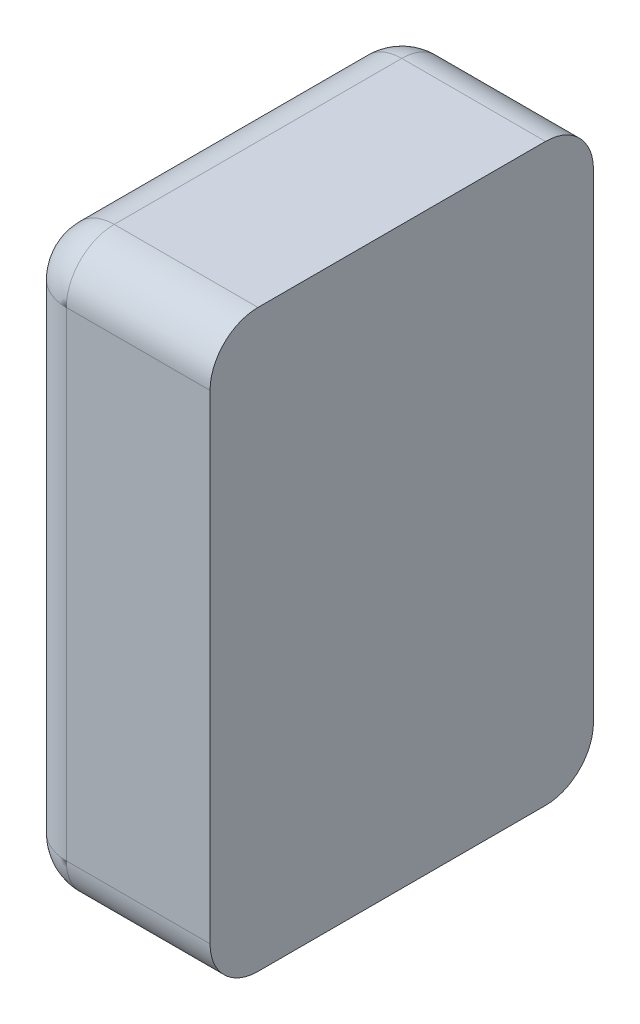
ISO-10303-21;
HEADER;
FILE_DESCRIPTION(('STEP AP214'),'2;1');
FILE_NAME('part.step','',(''),(''),'','','');
FILE_SCHEMA(('AUTOMOTIVE_DESIGN { 1 0 10303 214 1 1 1 1 }'));
ENDSEC;
DATA;
#1=APPLICATION_CONTEXT('core data for automotive mechanical design processes');
#2=APPLICATION_PROTOCOL_DEFINITION('international standard','automotive_design',2000,#1);
#3=PRODUCT_CONTEXT('',#1,'mechanical');
#4=PRODUCT('Part','Part','',(#3));
#5=PRODUCT_RELATED_PRODUCT_CATEGORY('part','',(#4));
#6=PRODUCT_DEFINITION_FORMATION('','',#4);
#7=PRODUCT_DEFINITION_CONTEXT('part definition',#1,'design');
#8=PRODUCT_DEFINITION('design','',#6,#7);
#9=PRODUCT_DEFINITION_SHAPE('','',#8);
#10=(LENGTH_UNIT() NAMED_UNIT(*) SI_UNIT(.MILLI.,.METRE.));
#11=(NAMED_UNIT(*) PLANE_ANGLE_UNIT() SI_UNIT($,.RADIAN.));
#12=(NAMED_UNIT(*) SI_UNIT($,.STERADIAN.) SOLID_ANGLE_UNIT());
#13=UNCERTAINTY_MEASURE_WITH_UNIT(LENGTH_MEASURE(1.E-05),#10,'distance_accuracy_value','');
#14=(GEOMETRIC_REPRESENTATION_CONTEXT(3) GLOBAL_UNCERTAINTY_ASSIGNED_CONTEXT((#13)) GLOBAL_UNIT_ASSIGNED_CONTEXT((#10,
#11,#12)) REPRESENTATION_CONTEXT('',''));
#15=CARTESIAN_POINT('',(0.,0.,0.));
#16=DIRECTION('',(0.,0.,1.));
#17=DIRECTION('',(1.,0.,0.));
#18=AXIS2_PLACEMENT_3D('',#15,#16,#17);
#19=CARTESIAN_POINT('',(-0.25,-0.15,0.));
#20=DIRECTION('',(0.,0.,1.));
#21=DIRECTION('',(1.,0.,0.));
#22=AXIS2_PLACEMENT_3D('',#19,#20,#21);
#23=PLANE('',#22);
#24=DIRECTION('',(0.,1.,0.));
#25=VECTOR('',#24,1.);
#26=CARTESIAN_POINT('',(-0.275,-0.15,0.));
#27=LINE('',#26,#25);
#28=CARTESIAN_POINT('',(-0.275,-0.125,0.));
#29=VERTEX_POINT('',#28);
#30=CARTESIAN_POINT('',(-0.275,0.125,0.));
#31=VERTEX_POINT('',#30);
#32=EDGE_CURVE('E197',#29,#31,#27,.T.);
#33=ORIENTED_EDGE('',*,*,#32,.T.);
#34=DIRECTION('',(1.,0.,0.));
#35=VECTOR('',#34,1.);
#36=CARTESIAN_POINT('',(-0.25,0.125,0.));
#37=LINE('',#36,#35);
#38=CARTESIAN_POINT('',(-0.2,0.125,0.));
#39=VERTEX_POINT('',#38);
#40=EDGE_CURVE('E124',#31,#39,#37,.T.);
#41=ORIENTED_EDGE('',*,*,#40,.T.);
#42=DIRECTION('',(0.,1.,0.));
#43=VECTOR('',#42,1.);
#44=CARTESIAN_POINT('',(-0.2,-0.15,0.));
#45=LINE('',#44,#43);
#46=CARTESIAN_POINT('',(-0.2,-0.125,0.));
#47=VERTEX_POINT('',#46);
#48=EDGE_CURVE('E242',#47,#39,#45,.T.);
#49=ORIENTED_EDGE('',*,*,#48,.F.);
#50=DIRECTION('',(-1.,0.,0.));
#51=VECTOR('',#50,1.);
#52=CARTESIAN_POINT('',(-0.3,-0.125,0.));
#53=LINE('',#52,#51);
#54=EDGE_CURVE('E200',#47,#29,#53,.T.);
#55=ORIENTED_EDGE('',*,*,#54,.T.);
#56=EDGE_LOOP('',(#33,#41,#49,#55));
#57=FACE_BOUND('',#56,.T.);
#58=ADVANCED_FACE('F17',(#57),#23,.F.);
#59=CARTESIAN_POINT('',(-0.15,-0.15,0.1));
#60=DIRECTION('',(0.,-1.,0.));
#61=DIRECTION('',(0.,0.,-1.));
#62=AXIS2_PLACEMENT_3D('',#59,#60,#61);
#63=PLANE('',#62);
#64=DIRECTION('',(0.,0.,1.));
#65=VECTOR('',#64,1.);
#66=CARTESIAN_POINT('',(-0.2,-0.15,0.189600024));
#67=LINE('',#66,#65);
#68=CARTESIAN_POINT('',(-0.2,-0.15,0.025));
#69=VERTEX_POINT('',#68);
#70=CARTESIAN_POINT('',(-0.2,-0.15,0.175));
#71=VERTEX_POINT('',#70);
#72=EDGE_CURVE('E219',#69,#71,#67,.T.);
#73=ORIENTED_EDGE('',*,*,#72,.T.);
#74=DIRECTION('',(-1.,0.,0.));
#75=VECTOR('',#74,1.);
#76=CARTESIAN_POINT('',(-0.3,-0.15,0.175));
#77=LINE('',#76,#75);
#78=CARTESIAN_POINT('',(-0.275,-0.15,0.175));
#79=VERTEX_POINT('',#78);
#80=EDGE_CURVE('E11',#71,#79,#77,.T.);
#81=ORIENTED_EDGE('',*,*,#80,.T.);
#82=DIRECTION('',(0.,0.,-1.));
#83=VECTOR('',#82,1.);
#84=CARTESIAN_POINT('',(-0.275,-0.15,0.));
#85=LINE('',#84,#83);
#86=CARTESIAN_POINT('',(-0.275,-0.15,0.025));
#87=VERTEX_POINT('',#86);
#88=EDGE_CURVE('E28',#79,#87,#85,.T.);
#89=ORIENTED_EDGE('',*,*,#88,.T.);
#90=DIRECTION('',(1.,0.,0.));
#91=VECTOR('',#90,1.);
#92=CARTESIAN_POINT('',(-0.2,-0.15,0.025));
#93=LINE('',#92,#91);
#94=EDGE_CURVE('E191',#87,#69,#93,.T.);
#95=ORIENTED_EDGE('',*,*,#94,.T.);
#96=EDGE_LOOP('',(#73,#81,#89,#95));
#97=FACE_BOUND('',#96,.T.);
#98=ADVANCED_FACE('F305',(#97),#63,.T.);
#99=CARTESIAN_POINT('',(-0.15,0.15,0.1));
#100=DIRECTION('',(0.,-1.,0.));
#101=DIRECTION('',(0.,0.,-1.));
#102=AXIS2_PLACEMENT_3D('',#99,#100,#101);
#103=PLANE('',#102);
#104=DIRECTION('',(0.,0.,1.));
#105=VECTOR('',#104,1.);
#106=CARTESIAN_POINT('',(-0.275,0.15,0.1));
#107=LINE('',#106,#105);
#108=CARTESIAN_POINT('',(-0.275,0.15,0.025));
#109=VERTEX_POINT('',#108);
#110=CARTESIAN_POINT('',(-0.275,0.15,0.175));
#111=VERTEX_POINT('',#110);
#112=EDGE_CURVE('E21',#109,#111,#107,.T.);
#113=ORIENTED_EDGE('',*,*,#112,.T.);
#114=DIRECTION('',(1.,0.,0.));
#115=VECTOR('',#114,1.);
#116=CARTESIAN_POINT('',(-0.15,0.15,0.175));
#117=LINE('',#116,#115);
#118=CARTESIAN_POINT('',(-0.2,0.15,0.175));
#119=VERTEX_POINT('',#118);
#120=EDGE_CURVE('E119',#111,#119,#117,.T.);
#121=ORIENTED_EDGE('',*,*,#120,.T.);
#122=DIRECTION('',(0.,0.,1.));
#123=VECTOR('',#122,1.);
#124=CARTESIAN_POINT('',(-0.2,0.15,0.189600024));
#125=LINE('',#124,#123);
#126=CARTESIAN_POINT('',(-0.2,0.15,0.025));
#127=VERTEX_POINT('',#126);
#128=EDGE_CURVE('E174',#127,#119,#125,.T.);
#129=ORIENTED_EDGE('',*,*,#128,.F.);
#130=DIRECTION('',(-1.,0.,0.));
#131=VECTOR('',#130,1.);
#132=CARTESIAN_POINT('',(-0.15,0.15,0.025));
#133=LINE('',#132,#131);
#134=EDGE_CURVE('E177',#127,#109,#133,.T.);
#135=ORIENTED_EDGE('',*,*,#134,.T.);
#136=EDGE_LOOP('',(#113,#121,#129,#135));
#137=FACE_BOUND('',#136,.T.);
#138=ADVANCED_FACE('F269',(#137),#103,.F.);
#139=CARTESIAN_POINT('',(-0.15,-0.125,0.175));
#140=DIRECTION('',(-1.,0.,0.));
#141=DIRECTION('',(0.,0.,-1.));
#142=AXIS2_PLACEMENT_3D('',#139,#140,#141);
#143=CYLINDRICAL_SURFACE('',#142,0.025);
#144=CARTESIAN_POINT('',(-0.2,-0.125,0.175));
#145=DIRECTION('',(1.,0.,0.));
#146=DIRECTION('',(0.,0.,1.));
#147=AXIS2_PLACEMENT_3D('',#144,#145,#146);
#148=CIRCLE('',#147,0.025);
#149=CARTESIAN_POINT('',(-0.2,-0.125,0.2));
#150=VERTEX_POINT('',#149);
#151=EDGE_CURVE('E160',#150,#71,#148,.T.);
#152=ORIENTED_EDGE('',*,*,#151,.F.);
#153=DIRECTION('',(1.,0.,0.));
#154=VECTOR('',#153,1.);
#155=CARTESIAN_POINT('',(-0.2,-0.125,0.2));
#156=LINE('',#155,#154);
#157=CARTESIAN_POINT('',(-0.275,-0.125,0.2));
#158=VERTEX_POINT('',#157);
#159=EDGE_CURVE('E146',#158,#150,#156,.T.);
#160=ORIENTED_EDGE('',*,*,#159,.F.);
#161=CARTESIAN_POINT('',(-0.275,-0.125,0.175));
#162=DIRECTION('',(-1.,0.,0.));
#163=DIRECTION('',(0.,0.,1.));
#164=AXIS2_PLACEMENT_3D('',#161,#162,#163);
#165=CIRCLE('',#164,0.025);
#166=EDGE_CURVE('E189',#79,#158,#165,.T.);
#167=ORIENTED_EDGE('',*,*,#166,.F.);
#168=ORIENTED_EDGE('',*,*,#80,.F.);
#169=EDGE_LOOP('',(#152,#160,#167,#168));
#170=FACE_BOUND('',#169,.T.);
#171=ADVANCED_FACE('F294',(#170),#143,.T.);
#172=CARTESIAN_POINT('',(-0.275,-0.125,0.1));
#173=DIRECTION('',(0.,0.,-1.));
#174=DIRECTION('',(1.,0.,0.));
#175=AXIS2_PLACEMENT_3D('',#172,#173,#174);
#176=CYLINDRICAL_SURFACE('',#175,0.025);
#177=CARTESIAN_POINT('',(-0.275,-0.125,0.025));
#178=DIRECTION('',(0.,0.,-1.));
#179=DIRECTION('',(-1.,0.,0.));
#180=AXIS2_PLACEMENT_3D('',#177,#178,#179);
#181=CIRCLE('',#180,0.025);
#182=CARTESIAN_POINT('',(-0.3,-0.125,0.025));
#183=VERTEX_POINT('',#182);
#184=EDGE_CURVE('E166',#87,#183,#181,.T.);
#185=ORIENTED_EDGE('',*,*,#184,.F.);
#186=ORIENTED_EDGE('',*,*,#88,.F.);
#187=CARTESIAN_POINT('',(-0.275,-0.125,0.175));
#188=DIRECTION('',(0.,0.,1.));
#189=DIRECTION('',(1.,0.,0.));
#190=AXIS2_PLACEMENT_3D('',#187,#188,#189);
#191=CIRCLE('',#190,0.025);
#192=CARTESIAN_POINT('',(-0.3,-0.125,0.175));
#193=VERTEX_POINT('',#192);
#194=EDGE_CURVE('E169',#193,#79,#191,.T.);
#195=ORIENTED_EDGE('',*,*,#194,.F.);
#196=DIRECTION('',(0.,0.,1.));
#197=VECTOR('',#196,1.);
#198=CARTESIAN_POINT('',(-0.3,-0.125,0.2));
#199=LINE('',#198,#197);
#200=EDGE_CURVE('E182',#183,#193,#199,.T.);
#201=ORIENTED_EDGE('',*,*,#200,.F.);
#202=EDGE_LOOP('',(#185,#186,#195,#201));
#203=FACE_BOUND('',#202,.T.);
#204=ADVANCED_FACE('F288',(#203),#176,.T.);
#205=CARTESIAN_POINT('',(-0.15,-0.125,0.025));
#206=DIRECTION('',(1.,0.,0.));
#207=DIRECTION('',(0.,0.,1.));
#208=AXIS2_PLACEMENT_3D('',#205,#206,#207);
#209=CYLINDRICAL_SURFACE('',#208,0.025);
#210=CARTESIAN_POINT('',(-0.2,-0.125,0.025));
#211=DIRECTION('',(1.,0.,0.));
#212=DIRECTION('',(0.,0.,1.));
#213=AXIS2_PLACEMENT_3D('',#210,#211,#212);
#214=CIRCLE('',#213,0.025);
#215=EDGE_CURVE('E222',#69,#47,#214,.T.);
#216=ORIENTED_EDGE('',*,*,#215,.F.);
#217=ORIENTED_EDGE('',*,*,#94,.F.);
#218=CARTESIAN_POINT('',(-0.275,-0.125,0.025));
#219=DIRECTION('',(-1.,0.,0.));
#220=DIRECTION('',(0.,0.,1.));
#221=AXIS2_PLACEMENT_3D('',#218,#219,#220);
#222=CIRCLE('',#221,0.025);
#223=EDGE_CURVE('E170',#29,#87,#222,.T.);
#224=ORIENTED_EDGE('',*,*,#223,.F.);
#225=ORIENTED_EDGE('',*,*,#54,.F.);
#226=EDGE_LOOP('',(#216,#217,#224,#225));
#227=FACE_BOUND('',#226,.T.);
#228=ADVANCED_FACE('F293',(#227),#209,.T.);
#229=CARTESIAN_POINT('',(-0.275,-0.125,0.175));
#230=DIRECTION('',(0.,0.,1.));
#231=DIRECTION('',(1.,0.,0.));
#232=AXIS2_PLACEMENT_3D('',#229,#230,#231);
#233=SPHERICAL_SURFACE('',#232,0.025);
#234=ORIENTED_EDGE('',*,*,#194,.T.);
#235=ORIENTED_EDGE('',*,*,#166,.T.);
#236=CARTESIAN_POINT('',(-0.275,-0.125,0.175));
#237=DIRECTION('',(0.,1.,0.));
#238=DIRECTION('',(0.,0.,-1.));
#239=AXIS2_PLACEMENT_3D('',#236,#237,#238);
#240=CIRCLE('',#239,0.025);
#241=EDGE_CURVE('E141',#193,#158,#240,.T.);
#242=ORIENTED_EDGE('',*,*,#241,.F.);
#243=EDGE_LOOP('',(#234,#235,#242));
#244=FACE_BOUND('',#243,.T.);
#245=ADVANCED_FACE('F314',(#244),#233,.T.);
#246=CARTESIAN_POINT('',(-0.275,-0.125,0.025));
#247=DIRECTION('',(0.,0.,1.));
#248=DIRECTION('',(1.,0.,0.));
#249=AXIS2_PLACEMENT_3D('',#246,#247,#248);
#250=SPHERICAL_SURFACE('',#249,0.025);
#251=ORIENTED_EDGE('',*,*,#223,.T.);
#252=ORIENTED_EDGE('',*,*,#184,.T.);
#253=CARTESIAN_POINT('',(-0.275,-0.125,0.025));
#254=DIRECTION('',(0.,1.,0.));
#255=DIRECTION('',(0.,0.,-1.));
#256=AXIS2_PLACEMENT_3D('',#253,#254,#255);
#257=CIRCLE('',#256,0.025);
#258=EDGE_CURVE('E193',#29,#183,#257,.T.);
#259=ORIENTED_EDGE('',*,*,#258,.F.);
#260=EDGE_LOOP('',(#251,#252,#259));
#261=FACE_BOUND('',#260,.T.);
#262=ADVANCED_FACE('F331',(#261),#250,.T.);
#263=CARTESIAN_POINT('',(-0.25,0.125,0.175));
#264=DIRECTION('',(1.,0.,0.));
#265=DIRECTION('',(0.,0.,1.));
#266=AXIS2_PLACEMENT_3D('',#263,#264,#265);
#267=CYLINDRICAL_SURFACE('',#266,0.025);
#268=CARTESIAN_POINT('',(-0.2,0.125,0.175));
#269=DIRECTION('',(1.,0.,0.));
#270=DIRECTION('',(0.,0.,1.));
#271=AXIS2_PLACEMENT_3D('',#268,#269,#270);
#272=CIRCLE('',#271,0.025);
#273=CARTESIAN_POINT('',(-0.2,0.125,0.2));
#274=VERTEX_POINT('',#273);
#275=EDGE_CURVE('E171',#119,#274,#272,.T.);
#276=ORIENTED_EDGE('',*,*,#275,.F.);
#277=ORIENTED_EDGE('',*,*,#120,.F.);
#278=CARTESIAN_POINT('',(-0.275,0.125,0.175));
#279=DIRECTION('',(-1.,0.,0.));
#280=DIRECTION('',(0.,0.,1.));
#281=AXIS2_PLACEMENT_3D('',#278,#279,#280);
#282=CIRCLE('',#281,0.025);
#283=CARTESIAN_POINT('',(-0.275,0.125,0.2));
#284=VERTEX_POINT('',#283);
#285=EDGE_CURVE('E112',#284,#111,#282,.T.);
#286=ORIENTED_EDGE('',*,*,#285,.F.);
#287=DIRECTION('',(-1.,0.,0.));
#288=VECTOR('',#287,1.);
#289=CARTESIAN_POINT('',(-0.25,0.125,0.2));
#290=LINE('',#289,#288);
#291=EDGE_CURVE('E117',#274,#284,#290,.T.);
#292=ORIENTED_EDGE('',*,*,#291,.F.);
#293=EDGE_LOOP('',(#276,#277,#286,#292));
#294=FACE_BOUND('',#293,.T.);
#295=ADVANCED_FACE('F115',(#294),#267,.T.);
#296=CARTESIAN_POINT('',(-0.275,-0.15,0.175));
#297=DIRECTION('',(0.,-1.,0.));
#298=DIRECTION('',(0.,0.,1.));
#299=AXIS2_PLACEMENT_3D('',#296,#297,#298);
#300=CYLINDRICAL_SURFACE('',#299,0.025);
#301=ORIENTED_EDGE('',*,*,#241,.T.);
#302=DIRECTION('',(0.,-1.,0.));
#303=VECTOR('',#302,1.);
#304=CARTESIAN_POINT('',(-0.275,-0.15,0.2));
#305=LINE('',#304,#303);
#306=EDGE_CURVE('E138',#284,#158,#305,.T.);
#307=ORIENTED_EDGE('',*,*,#306,.F.);
#308=CARTESIAN_POINT('',(-0.275,0.125,0.175));
#309=DIRECTION('',(0.,1.,0.));
#310=DIRECTION('',(0.,0.,1.));
#311=AXIS2_PLACEMENT_3D('',#308,#309,#310);
#312=CIRCLE('',#311,0.025);
#313=CARTESIAN_POINT('',(-0.3,0.125,0.175));
#314=VERTEX_POINT('',#313);
#315=EDGE_CURVE('E125',#314,#284,#312,.T.);
#316=ORIENTED_EDGE('',*,*,#315,.F.);
#317=DIRECTION('',(0.,1.,0.));
#318=VECTOR('',#317,1.);
#319=CARTESIAN_POINT('',(-0.3,-0.15,0.175));
#320=LINE('',#319,#318);
#321=EDGE_CURVE('E161',#193,#314,#320,.T.);
#322=ORIENTED_EDGE('',*,*,#321,.F.);
#323=EDGE_LOOP('',(#301,#307,#316,#322));
#324=FACE_BOUND('',#323,.T.);
#325=ADVANCED_FACE('F139',(#324),#300,.T.);
#326=CARTESIAN_POINT('',(-0.275,-0.15,0.025));
#327=DIRECTION('',(0.,-1.,0.));
#328=DIRECTION('',(0.,0.,1.));
#329=AXIS2_PLACEMENT_3D('',#326,#327,#328);
#330=CYLINDRICAL_SURFACE('',#329,0.025);
#331=ORIENTED_EDGE('',*,*,#258,.T.);
#332=DIRECTION('',(0.,-1.,0.));
#333=VECTOR('',#332,1.);
#334=CARTESIAN_POINT('',(-0.3,-0.15,0.025));
#335=LINE('',#334,#333);
#336=CARTESIAN_POINT('',(-0.3,0.125,0.025));
#337=VERTEX_POINT('',#336);
#338=EDGE_CURVE('E178',#337,#183,#335,.T.);
#339=ORIENTED_EDGE('',*,*,#338,.F.);
#340=CARTESIAN_POINT('',(-0.275,0.125,0.025));
#341=DIRECTION('',(0.,1.,0.));
#342=DIRECTION('',(0.,0.,1.));
#343=AXIS2_PLACEMENT_3D('',#340,#341,#342);
#344=CIRCLE('',#343,0.025);
#345=EDGE_CURVE('E134',#31,#337,#344,.T.);
#346=ORIENTED_EDGE('',*,*,#345,.F.);
#347=ORIENTED_EDGE('',*,*,#32,.F.);
#348=EDGE_LOOP('',(#331,#339,#346,#347));
#349=FACE_BOUND('',#348,.T.);
#350=ADVANCED_FACE('F345',(#349),#330,.T.);
#351=CARTESIAN_POINT('',(-0.25,0.125,0.025));
#352=DIRECTION('',(-1.,0.,0.));
#353=DIRECTION('',(0.,0.,-1.));
#354=AXIS2_PLACEMENT_3D('',#351,#352,#353);
#355=CYLINDRICAL_SURFACE('',#354,0.025);
#356=CARTESIAN_POINT('',(-0.2,0.125,0.025));
#357=DIRECTION('',(1.,0.,0.));
#358=DIRECTION('',(0.,0.,1.));
#359=AXIS2_PLACEMENT_3D('',#356,#357,#358);
#360=CIRCLE('',#359,0.025);
#361=EDGE_CURVE('E215',#39,#127,#360,.T.);
#362=ORIENTED_EDGE('',*,*,#361,.F.);
#363=ORIENTED_EDGE('',*,*,#40,.F.);
#364=CARTESIAN_POINT('',(-0.275,0.125,0.025));
#365=DIRECTION('',(-1.,0.,0.));
#366=DIRECTION('',(0.,0.,1.));
#367=AXIS2_PLACEMENT_3D('',#364,#365,#366);
#368=CIRCLE('',#367,0.025);
#369=EDGE_CURVE('E165',#109,#31,#368,.T.);
#370=ORIENTED_EDGE('',*,*,#369,.F.);
#371=ORIENTED_EDGE('',*,*,#134,.F.);
#372=EDGE_LOOP('',(#362,#363,#370,#371));
#373=FACE_BOUND('',#372,.T.);
#374=ADVANCED_FACE('F266',(#373),#355,.T.);
#375=CARTESIAN_POINT('',(-0.275,0.125,0.175));
#376=DIRECTION('',(0.,0.,1.));
#377=DIRECTION('',(1.,0.,0.));
#378=AXIS2_PLACEMENT_3D('',#375,#376,#377);
#379=SPHERICAL_SURFACE('',#378,0.025);
#380=ORIENTED_EDGE('',*,*,#315,.T.);
#381=ORIENTED_EDGE('',*,*,#285,.T.);
#382=CARTESIAN_POINT('',(-0.275,0.125,0.175));
#383=DIRECTION('',(0.,0.,-1.));
#384=DIRECTION('',(1.,0.,0.));
#385=AXIS2_PLACEMENT_3D('',#382,#383,#384);
#386=CIRCLE('',#385,0.025);
#387=EDGE_CURVE('E129',#314,#111,#386,.T.);
#388=ORIENTED_EDGE('',*,*,#387,.F.);
#389=EDGE_LOOP('',(#380,#381,#388));
#390=FACE_BOUND('',#389,.T.);
#391=ADVANCED_FACE('F19',(#390),#379,.T.);
#392=CARTESIAN_POINT('',(-0.275,0.125,0.025));
#393=DIRECTION('',(0.,0.,1.));
#394=DIRECTION('',(1.,0.,0.));
#395=AXIS2_PLACEMENT_3D('',#392,#393,#394);
#396=SPHERICAL_SURFACE('',#395,0.025);
#397=ORIENTED_EDGE('',*,*,#369,.T.);
#398=ORIENTED_EDGE('',*,*,#345,.T.);
#399=CARTESIAN_POINT('',(-0.275,0.125,0.025));
#400=DIRECTION('',(0.,0.,1.));
#401=DIRECTION('',(-1.,0.,0.));
#402=AXIS2_PLACEMENT_3D('',#399,#400,#401);
#403=CIRCLE('',#402,0.025);
#404=EDGE_CURVE('E203',#109,#337,#403,.T.);
#405=ORIENTED_EDGE('',*,*,#404,.F.);
#406=EDGE_LOOP('',(#397,#398,#405));
#407=FACE_BOUND('',#406,.T.);
#408=ADVANCED_FACE('F281',(#407),#396,.T.);
#409=CARTESIAN_POINT('',(-0.275,0.125,0.1));
#410=DIRECTION('',(0.,0.,1.));
#411=DIRECTION('',(-1.,0.,0.));
#412=AXIS2_PLACEMENT_3D('',#409,#410,#411);
#413=CYLINDRICAL_SURFACE('',#412,0.025);
#414=ORIENTED_EDGE('',*,*,#387,.T.);
#415=ORIENTED_EDGE('',*,*,#112,.F.);
#416=ORIENTED_EDGE('',*,*,#404,.T.);
#417=DIRECTION('',(0.,0.,-1.));
#418=VECTOR('',#417,1.);
#419=CARTESIAN_POINT('',(-0.3,0.125,0.1));
#420=LINE('',#419,#418);
#421=EDGE_CURVE('E183',#314,#337,#420,.T.);
#422=ORIENTED_EDGE('',*,*,#421,.F.);
#423=EDGE_LOOP('',(#414,#415,#416,#422));
#424=FACE_BOUND('',#423,.T.);
#425=ADVANCED_FACE('F324',(#424),#413,.T.);
#426=CARTESIAN_POINT('',(-0.2,-0.15,0.189600024));
#427=DIRECTION('',(-1.,0.,0.));
#428=DIRECTION('',(0.,0.,1.));
#429=AXIS2_PLACEMENT_3D('',#426,#427,#428);
#430=PLANE('',#429);
#431=ORIENTED_EDGE('',*,*,#128,.T.);
#432=ORIENTED_EDGE('',*,*,#275,.T.);
#433=DIRECTION('',(0.,1.,0.));
#434=VECTOR('',#433,1.);
#435=CARTESIAN_POINT('',(-0.2,-0.15,0.2));
#436=LINE('',#435,#434);
#437=EDGE_CURVE('E150',#150,#274,#436,.T.);
#438=ORIENTED_EDGE('',*,*,#437,.F.);
#439=ORIENTED_EDGE('',*,*,#151,.T.);
#440=ORIENTED_EDGE('',*,*,#72,.F.);
#441=ORIENTED_EDGE('',*,*,#215,.T.);
#442=ORIENTED_EDGE('',*,*,#48,.T.);
#443=ORIENTED_EDGE('',*,*,#361,.T.);
#444=EDGE_LOOP('',(#431,#432,#438,#439,#440,#441,#442,#443));
#445=FACE_BOUND('',#444,.T.);
#446=ADVANCED_FACE('F254',(#445),#430,.F.);
#447=CARTESIAN_POINT('',(-0.3,-0.15,0.1));
#448=DIRECTION('',(1.,0.,0.));
#449=DIRECTION('',(0.,1.,0.));
#450=AXIS2_PLACEMENT_3D('',#447,#448,#449);
#451=PLANE('',#450);
#452=ORIENTED_EDGE('',*,*,#321,.T.);
#453=ORIENTED_EDGE('',*,*,#421,.T.);
#454=ORIENTED_EDGE('',*,*,#338,.T.);
#455=ORIENTED_EDGE('',*,*,#200,.T.);
#456=EDGE_LOOP('',(#452,#453,#454,#455));
#457=FACE_BOUND('',#456,.T.);
#458=ADVANCED_FACE('F363',(#457),#451,.F.);
#459=CARTESIAN_POINT('',(-0.25,-0.15,0.2));
#460=DIRECTION('',(0.,0.,-1.));
#461=DIRECTION('',(0.,-1.,0.));
#462=AXIS2_PLACEMENT_3D('',#459,#460,#461);
#463=PLANE('',#462);
#464=ORIENTED_EDGE('',*,*,#437,.T.);
#465=ORIENTED_EDGE('',*,*,#291,.T.);
#466=ORIENTED_EDGE('',*,*,#306,.T.);
#467=ORIENTED_EDGE('',*,*,#159,.T.);
#468=EDGE_LOOP('',(#464,#465,#466,#467));
#469=FACE_BOUND('',#468,.T.);
#470=ADVANCED_FACE('F148',(#469),#463,.F.);
#471=CLOSED_SHELL('',(#58,#98,#138,#171,#204,#228,#245,#262,#295,#325,#350,#374,#391,#408,#425,
#446,#458,#470));
#472=MANIFOLD_SOLID_BREP('B1',#471);
#473=ADVANCED_BREP_SHAPE_REPRESENTATION('',(#18,#472),#14);
#474=SHAPE_DEFINITION_REPRESENTATION(#9,#473);
ENDSEC;
END-ISO-10303-21;
